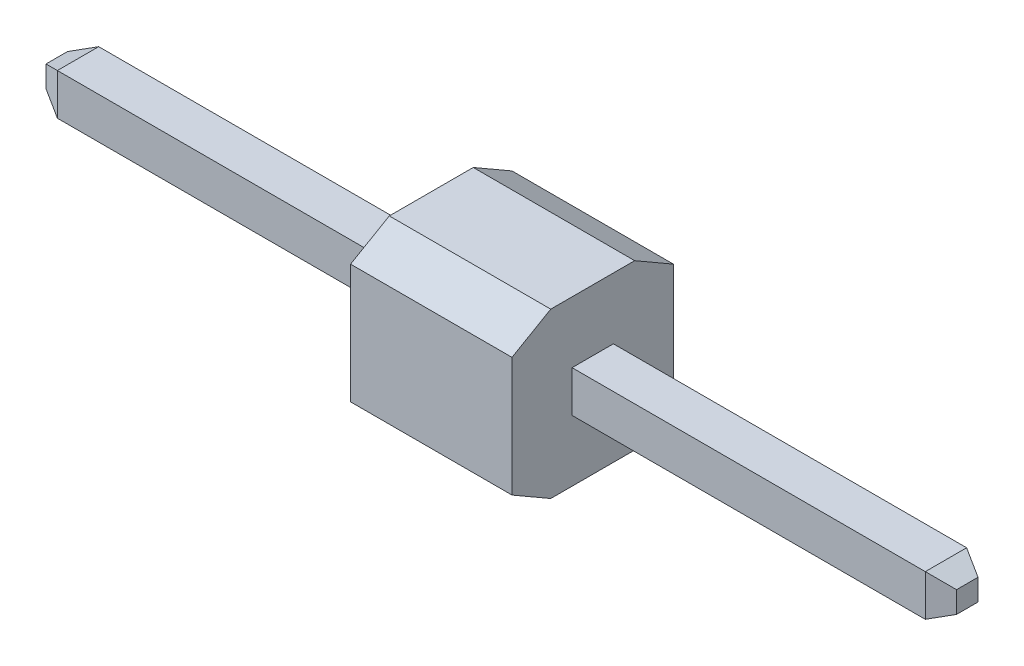
ISO-10303-21;
HEADER;
FILE_DESCRIPTION(('STEP AP214'),'2;1');
FILE_NAME('part.step','',(''),(''),'','','');
FILE_SCHEMA(('AUTOMOTIVE_DESIGN { 1 0 10303 214 1 1 1 1 }'));
ENDSEC;
DATA;
#1=APPLICATION_CONTEXT('core data for automotive mechanical design processes');
#2=APPLICATION_PROTOCOL_DEFINITION('international standard','automotive_design',2000,#1);
#3=PRODUCT_CONTEXT('',#1,'mechanical');
#4=PRODUCT('Part','Part','',(#3));
#5=PRODUCT_RELATED_PRODUCT_CATEGORY('part','',(#4));
#6=PRODUCT_DEFINITION_FORMATION('','',#4);
#7=PRODUCT_DEFINITION_CONTEXT('part definition',#1,'design');
#8=PRODUCT_DEFINITION('design','',#6,#7);
#9=PRODUCT_DEFINITION_SHAPE('','',#8);
#10=(LENGTH_UNIT() NAMED_UNIT(*) SI_UNIT(.MILLI.,.METRE.));
#11=(NAMED_UNIT(*) PLANE_ANGLE_UNIT() SI_UNIT($,.RADIAN.));
#12=(NAMED_UNIT(*) SI_UNIT($,.STERADIAN.) SOLID_ANGLE_UNIT());
#13=UNCERTAINTY_MEASURE_WITH_UNIT(LENGTH_MEASURE(1.E-05),#10,'distance_accuracy_value','');
#14=(GEOMETRIC_REPRESENTATION_CONTEXT(3) GLOBAL_UNCERTAINTY_ASSIGNED_CONTEXT((#13)) GLOBAL_UNIT_ASSIGNED_CONTEXT((#10,
#11,#12)) REPRESENTATION_CONTEXT('',''));
#15=CARTESIAN_POINT('',(0.,0.,0.));
#16=DIRECTION('',(0.,0.,1.));
#17=DIRECTION('',(1.,0.,0.));
#18=AXIS2_PLACEMENT_3D('',#15,#16,#17);
#19=CARTESIAN_POINT('',(5.42110170937414,13.0171157260571,-2.77112170583403));
#20=DIRECTION('',(1.,-9.93476518829084E-08,4.37113882867379E-08));
#21=DIRECTION('',(-9.93476589883358E-08,-1.,8.74227765734759E-08));
#22=AXIS2_PLACEMENT_3D('',#19,#20,#21);
#23=PLANE('',#22);
#24=DIRECTION('',(-1.18186632779335E-08,-0.50000007571054,-0.866025360072934));
#25=VECTOR('',#24,1.);
#26=CARTESIAN_POINT('',(5.42110151719953,11.7735260248209,-1.20112159711595));
#27=LINE('',#26,#25);
#28=CARTESIAN_POINT('',(5.42110151719953,11.7735260248209,-1.20112159711595));
#29=VERTEX_POINT('',#28);
#30=CARTESIAN_POINT('',(5.42110150901132,11.4271158108572,-1.80112156683181));
#31=VERTEX_POINT('',#30);
#32=EDGE_CURVE('E11',#29,#31,#27,.T.);
#33=ORIENTED_EDGE('',*,*,#32,.T.);
#34=DIRECTION('',(4.37113811813104E-08,-8.74227842254741E-08,-0.999999999999995));
#35=VECTOR('',#34,1.);
#36=CARTESIAN_POINT('',(5.42110150901132,11.4271158108572,-1.80112156683181));
#37=LINE('',#36,#35);
#38=CARTESIAN_POINT('',(5.42110156583612,11.4271156972076,-3.10112156683181));
#39=VERTEX_POINT('',#38);
#40=EDGE_CURVE('E304',#31,#39,#37,.T.);
#41=ORIENTED_EDGE('',*,*,#40,.T.);
#42=DIRECTION('',(8.75289963531793E-08,0.499999924289839,-0.866025447495712));
#43=VECTOR('',#42,1.);
#44=CARTESIAN_POINT('',(5.42110156583612,11.4271156972076,-3.10112156683181));
#45=LINE('',#44,#43);
#46=CARTESIAN_POINT('',(5.42110162647799,11.773525806264,-3.70112159711595));
#47=VERTEX_POINT('',#46);
#48=EDGE_CURVE('E296',#39,#47,#45,.T.);
#49=ORIENTED_EDGE('',*,*,#48,.T.);
#50=DIRECTION('',(9.93476588436478E-08,0.999999999999991,-8.74227764822788E-08));
#51=VECTOR('',#50,1.);
#52=CARTESIAN_POINT('',(5.42110162647799,11.773525806264,-3.70112159711595));
#53=LINE('',#52,#51);
#54=CARTESIAN_POINT('',(5.42110180999096,13.620705483234,-3.70112175860153));
#55=VERTEX_POINT('',#54);
#56=EDGE_CURVE('E281',#47,#55,#53,.T.);
#57=ORIENTED_EDGE('',*,*,#56,.T.);
#58=DIRECTION('',(-1.18186632778483E-08,-0.500000075710537,-0.866025360072935));
#59=VECTOR('',#58,1.);
#60=CARTESIAN_POINT('',(5.42110181817917,13.9671156972076,-3.10112178888567));
#61=LINE('',#60,#59);
#62=CARTESIAN_POINT('',(5.42110181817917,13.9671156972076,-3.10112178888567));
#63=VERTEX_POINT('',#62);
#64=EDGE_CURVE('E265',#63,#55,#61,.T.);
#65=ORIENTED_EDGE('',*,*,#64,.F.);
#66=DIRECTION('',(4.37113811813104E-08,-8.74227842254741E-08,-0.999999999999995));
#67=VECTOR('',#66,1.);
#68=CARTESIAN_POINT('',(5.42110176135438,13.9671158108572,-1.80112178888567));
#69=LINE('',#68,#67);
#70=CARTESIAN_POINT('',(5.42110176135438,13.9671158108572,-1.80112178888567));
#71=VERTEX_POINT('',#70);
#72=EDGE_CURVE('E248',#71,#63,#69,.T.);
#73=ORIENTED_EDGE('',*,*,#72,.F.);
#74=DIRECTION('',(8.75289963525477E-08,0.499999924289836,-0.866025447495714));
#75=VECTOR('',#74,1.);
#76=CARTESIAN_POINT('',(5.42110170071251,13.6207057017909,-1.20112175860153));
#77=LINE('',#76,#75);
#78=CARTESIAN_POINT('',(5.42110170071251,13.6207057017909,-1.20112175860153));
#79=VERTEX_POINT('',#78);
#80=EDGE_CURVE('E242',#79,#71,#77,.T.);
#81=ORIENTED_EDGE('',*,*,#80,.F.);
#82=DIRECTION('',(9.93476588436478E-08,0.999999999999991,-8.74227763620714E-08));
#83=VECTOR('',#82,1.);
#84=CARTESIAN_POINT('',(5.42110151719953,11.7735260248209,-1.20112159711595));
#85=LINE('',#84,#83);
#86=EDGE_CURVE('E236',#29,#79,#85,.T.);
#87=ORIENTED_EDGE('',*,*,#86,.F.);
#88=EDGE_LOOP('',(#33,#41,#49,#57,#65,#73,#81,#87));
#89=FACE_BOUND('',#88,.T.);
#90=DIRECTION('',(-4.37113803486431E-08,8.74227856773042E-08,0.999999999999995));
#91=VECTOR('',#90,1.);
#92=CARTESIAN_POINT('',(5.42110164579164,12.3771157260571,-2.77112164988345));
#93=LINE('',#92,#91);
#94=CARTESIAN_POINT('',(5.42110164579164,12.3771157260571,-2.77112164988345));
#95=VERTEX_POINT('',#94);
#96=CARTESIAN_POINT('',(5.42110161781636,12.3771157820077,-2.13112164988345));
#97=VERTEX_POINT('',#96);
#98=EDGE_CURVE('E302',#95,#97,#93,.T.);
#99=ORIENTED_EDGE('',*,*,#98,.T.);
#100=DIRECTION('',(-9.93476578781123E-08,-0.999999999999991,8.74227766567422E-08));
#101=VECTOR('',#100,1.);
#102=CARTESIAN_POINT('',(5.42110168139886,13.0171157820077,-2.13112170583403));
#103=LINE('',#102,#101);
#104=CARTESIAN_POINT('',(5.42110168139886,13.0171157820077,-2.13112170583403));
#105=VERTEX_POINT('',#104);
#106=EDGE_CURVE('E293',#105,#97,#103,.T.);
#107=ORIENTED_EDGE('',*,*,#106,.F.);
#108=DIRECTION('',(-4.37113817364219E-08,8.74227856773042E-08,0.999999999999995));
#109=VECTOR('',#108,1.);
#110=CARTESIAN_POINT('',(5.42110170937414,13.0171157260571,-2.77112170583403));
#111=LINE('',#110,#109);
#112=CARTESIAN_POINT('',(5.42110170937414,13.0171157260571,-2.77112170583403));
#113=VERTEX_POINT('',#112);
#114=EDGE_CURVE('E278',#113,#105,#111,.T.);
#115=ORIENTED_EDGE('',*,*,#114,.F.);
#116=DIRECTION('',(-9.93476592658911E-08,-0.999999999999991,8.74227766567422E-08));
#117=VECTOR('',#116,1.);
#118=CARTESIAN_POINT('',(5.42110170937414,13.0171157260571,-2.77112170583403));
#119=LINE('',#118,#117);
#120=EDGE_CURVE('E263',#113,#95,#119,.T.);
#121=ORIENTED_EDGE('',*,*,#120,.T.);
#122=EDGE_LOOP('',(#99,#107,#115,#121));
#123=FACE_BOUND('',#122,.T.);
#124=ADVANCED_FACE('F17',(#89,#123),#23,.T.);
#125=CARTESIAN_POINT('',(2.92110170937414,13.0171159744263,-2.7711218151125));
#126=DIRECTION('',(1.,-9.93476518829084E-08,4.37113882867379E-08));
#127=DIRECTION('',(-9.93476589883358E-08,-1.,8.74227765734759E-08));
#128=AXIS2_PLACEMENT_3D('',#125,#126,#127);
#129=PLANE('',#128);
#130=DIRECTION('',(-1.1818662636946E-08,-0.50000007571054,-0.866025360072934));
#131=VECTOR('',#130,1.);
#132=CARTESIAN_POINT('',(2.92110151719953,11.77352627319,-1.20112170639442));
#133=LINE('',#132,#131);
#134=CARTESIAN_POINT('',(2.92110151719953,11.77352627319,-1.20112170639442));
#135=VERTEX_POINT('',#134);
#136=CARTESIAN_POINT('',(2.92110150901132,11.4271160592264,-1.80112167611028));
#137=VERTEX_POINT('',#136);
#138=EDGE_CURVE('E24',#135,#137,#133,.T.);
#139=ORIENTED_EDGE('',*,*,#138,.F.);
#140=DIRECTION('',(9.93476590840625E-08,0.999999999999991,-8.74227763620714E-08));
#141=VECTOR('',#140,1.);
#142=CARTESIAN_POINT('',(2.92110151719953,11.77352627319,-1.20112170639442));
#143=LINE('',#142,#141);
#144=CARTESIAN_POINT('',(2.92110170071251,13.62070595016,-1.20112186788));
#145=VERTEX_POINT('',#144);
#146=EDGE_CURVE('E300',#135,#145,#143,.T.);
#147=ORIENTED_EDGE('',*,*,#146,.T.);
#148=DIRECTION('',(8.75289957115602E-08,0.499999924289836,-0.866025447495714));
#149=VECTOR('',#148,1.);
#150=CARTESIAN_POINT('',(2.92110170071251,13.62070595016,-1.20112186788));
#151=LINE('',#150,#149);
#152=CARTESIAN_POINT('',(2.92110176135438,13.9671160592264,-1.80112189816414));
#153=VERTEX_POINT('',#152);
#154=EDGE_CURVE('E286',#145,#153,#151,.T.);
#155=ORIENTED_EDGE('',*,*,#154,.T.);
#156=DIRECTION('',(4.37113811813104E-08,-8.74227842254741E-08,-0.999999999999995));
#157=VECTOR('',#156,1.);
#158=CARTESIAN_POINT('',(2.92110176135438,13.9671160592264,-1.80112189816414));
#159=LINE('',#158,#157);
#160=CARTESIAN_POINT('',(2.92110181817917,13.9671159455768,-3.10112189816414));
#161=VERTEX_POINT('',#160);
#162=EDGE_CURVE('E271',#153,#161,#159,.T.);
#163=ORIENTED_EDGE('',*,*,#162,.T.);
#164=DIRECTION('',(-1.18186626368607E-08,-0.500000075710537,-0.866025360072935));
#165=VECTOR('',#164,1.);
#166=CARTESIAN_POINT('',(2.92110181817917,13.9671159455768,-3.10112189816414));
#167=LINE('',#166,#165);
#168=CARTESIAN_POINT('',(2.92110180999096,13.6207057316031,-3.70112186788));
#169=VERTEX_POINT('',#168);
#170=EDGE_CURVE('E253',#161,#169,#167,.T.);
#171=ORIENTED_EDGE('',*,*,#170,.T.);
#172=DIRECTION('',(9.93476590840625E-08,0.999999999999991,-8.74227764822788E-08));
#173=VECTOR('',#172,1.);
#174=CARTESIAN_POINT('',(2.92110162647799,11.7735260546331,-3.70112170639442));
#175=LINE('',#174,#173);
#176=CARTESIAN_POINT('',(2.92110162647799,11.7735260546331,-3.70112170639442));
#177=VERTEX_POINT('',#176);
#178=EDGE_CURVE('E261',#177,#169,#175,.T.);
#179=ORIENTED_EDGE('',*,*,#178,.F.);
#180=DIRECTION('',(8.75289957121918E-08,0.499999924289839,-0.866025447495712));
#181=VECTOR('',#180,1.);
#182=CARTESIAN_POINT('',(2.92110156583612,11.4271159455767,-3.10112167611028));
#183=LINE('',#182,#181);
#184=CARTESIAN_POINT('',(2.92110156583612,11.4271159455767,-3.10112167611028));
#185=VERTEX_POINT('',#184);
#186=EDGE_CURVE('E276',#185,#177,#183,.T.);
#187=ORIENTED_EDGE('',*,*,#186,.F.);
#188=DIRECTION('',(4.37113811813104E-08,-8.74227842254741E-08,-0.999999999999995));
#189=VECTOR('',#188,1.);
#190=CARTESIAN_POINT('',(2.92110150901132,11.4271160592264,-1.80112167611028));
#191=LINE('',#190,#189);
#192=EDGE_CURVE('E291',#137,#185,#191,.T.);
#193=ORIENTED_EDGE('',*,*,#192,.F.);
#194=EDGE_LOOP('',(#139,#147,#155,#163,#171,#179,#187,#193));
#195=FACE_BOUND('',#194,.T.);
#196=DIRECTION('',(-9.93476592658911E-08,-0.999999999999991,8.74227766567422E-08));
#197=VECTOR('',#196,1.);
#198=CARTESIAN_POINT('',(2.92110168139886,13.0171160303769,-2.1311218151125));
#199=LINE('',#198,#197);
#200=CARTESIAN_POINT('',(2.92110168139886,13.0171160303769,-2.1311218151125));
#201=VERTEX_POINT('',#200);
#202=CARTESIAN_POINT('',(2.92110161781636,12.3771160303769,-2.13112175916192));
#203=VERTEX_POINT('',#202);
#204=EDGE_CURVE('E298',#201,#203,#199,.T.);
#205=ORIENTED_EDGE('',*,*,#204,.T.);
#206=DIRECTION('',(-4.37113810425325E-08,8.74227856773042E-08,0.999999999999995));
#207=VECTOR('',#206,1.);
#208=CARTESIAN_POINT('',(2.92110164579164,12.3771159744263,-2.77112175916192));
#209=LINE('',#208,#207);
#210=CARTESIAN_POINT('',(2.92110164579164,12.3771159744263,-2.77112175916192));
#211=VERTEX_POINT('',#210);
#212=EDGE_CURVE('E283',#211,#203,#209,.T.);
#213=ORIENTED_EDGE('',*,*,#212,.F.);
#214=DIRECTION('',(-9.93476592658911E-08,-0.999999999999991,8.74227766567422E-08));
#215=VECTOR('',#214,1.);
#216=CARTESIAN_POINT('',(2.92110170937414,13.0171159744263,-2.7711218151125));
#217=LINE('',#216,#215);
#218=CARTESIAN_POINT('',(2.92110170937414,13.0171159744263,-2.7711218151125));
#219=VERTEX_POINT('',#218);
#220=EDGE_CURVE('E268',#219,#211,#217,.T.);
#221=ORIENTED_EDGE('',*,*,#220,.F.);
#222=DIRECTION('',(-4.37113810425325E-08,8.74227856773042E-08,0.999999999999995));
#223=VECTOR('',#222,1.);
#224=CARTESIAN_POINT('',(2.92110170937414,13.0171159744263,-2.7711218151125));
#225=LINE('',#224,#223);
#226=EDGE_CURVE('E251',#219,#201,#225,.T.);
#227=ORIENTED_EDGE('',*,*,#226,.T.);
#228=EDGE_LOOP('',(#205,#213,#221,#227));
#229=FACE_BOUND('',#228,.T.);
#230=ADVANCED_FACE('F314',(#195,#229),#129,.F.);
#231=CARTESIAN_POINT('',(5.42110151719953,11.7735260248209,-1.20112159711595));
#232=DIRECTION('',(1.07893287081065E-07,0.866025360072937,-0.500000075710535));
#233=DIRECTION('',(1.18186629566715E-08,0.500000075710542,0.866025360072941));
#234=AXIS2_PLACEMENT_3D('',#231,#232,#233);
#235=PLANE('',#234);
#236=ORIENTED_EDGE('',*,*,#138,.T.);
#237=DIRECTION('',(-0.999999999999994,9.93476533039933E-08,-4.37113883755555E-08));
#238=VECTOR('',#237,1.);
#239=CARTESIAN_POINT('',(5.42110150901132,11.4271158108572,-1.80112156683181));
#240=LINE('',#239,#238);
#241=EDGE_CURVE('E288',#31,#137,#240,.T.);
#242=ORIENTED_EDGE('',*,*,#241,.F.);
#243=ORIENTED_EDGE('',*,*,#32,.F.);
#244=DIRECTION('',(-0.999999999999994,9.93476504618223E-08,-4.3711388109102E-08));
#245=VECTOR('',#244,1.);
#246=CARTESIAN_POINT('',(5.42110151719953,11.7735260248209,-1.20112159711595));
#247=LINE('',#246,#245);
#248=EDGE_CURVE('E256',#29,#135,#247,.T.);
#249=ORIENTED_EDGE('',*,*,#248,.T.);
#250=EDGE_LOOP('',(#236,#242,#243,#249));
#251=FACE_BOUND('',#250,.T.);
#252=ADVANCED_FACE('F306',(#251),#235,.F.);
#253=CARTESIAN_POINT('',(5.42110150901132,11.4271158108572,-1.80112156683181));
#254=DIRECTION('',(9.93476589883358E-08,1.,-8.74227765734759E-08));
#255=DIRECTION('',(1.,-9.93476518829084E-08,4.37113882867379E-08));
#256=AXIS2_PLACEMENT_3D('',#253,#254,#255);
#257=PLANE('',#256);
#258=ORIENTED_EDGE('',*,*,#192,.T.);
#259=DIRECTION('',(-0.999999999999994,9.93476533039933E-08,-4.37113884643734E-08));
#260=VECTOR('',#259,1.);
#261=CARTESIAN_POINT('',(5.42110156583612,11.4271156972076,-3.10112156683181));
#262=LINE('',#261,#260);
#263=EDGE_CURVE('E273',#39,#185,#262,.T.);
#264=ORIENTED_EDGE('',*,*,#263,.F.);
#265=ORIENTED_EDGE('',*,*,#40,.F.);
#266=ORIENTED_EDGE('',*,*,#241,.T.);
#267=EDGE_LOOP('',(#258,#264,#265,#266));
#268=FACE_BOUND('',#267,.T.);
#269=ADVANCED_FACE('F311',(#268),#257,.F.);
#270=CARTESIAN_POINT('',(5.42110156583612,11.4271156972076,-3.10112156683181));
#271=DIRECTION('',(6.41819058997377E-08,0.866025447495721,0.499999924289845));
#272=DIRECTION('',(-8.7528996031702E-08,-0.499999924289838,0.866025447495717));
#273=AXIS2_PLACEMENT_3D('',#270,#271,#272);
#274=PLANE('',#273);
#275=ORIENTED_EDGE('',*,*,#186,.T.);
#276=DIRECTION('',(-0.999999999999994,9.93476504618223E-08,-4.37113882867377E-08));
#277=VECTOR('',#276,1.);
#278=CARTESIAN_POINT('',(5.42110162647799,11.773525806264,-3.70112159711595));
#279=LINE('',#278,#277);
#280=EDGE_CURVE('E258',#47,#177,#279,.T.);
#281=ORIENTED_EDGE('',*,*,#280,.F.);
#282=ORIENTED_EDGE('',*,*,#48,.F.);
#283=ORIENTED_EDGE('',*,*,#263,.T.);
#284=EDGE_LOOP('',(#275,#281,#282,#283));
#285=FACE_BOUND('',#284,.T.);
#286=ADVANCED_FACE('F319',(#285),#274,.F.);
#287=CARTESIAN_POINT('',(5.42110162647799,11.773525806264,-3.70112159711595));
#288=DIRECTION('',(-4.37113811813106E-08,8.74227836789032E-08,1.));
#289=DIRECTION('',(-1.,9.93476518829084E-08,-4.37113882867379E-08));
#290=AXIS2_PLACEMENT_3D('',#287,#288,#289);
#291=PLANE('',#290);
#292=ORIENTED_EDGE('',*,*,#178,.T.);
#293=DIRECTION('',(-0.999999999999994,9.93476533039933E-08,-4.37113884643734E-08));
#294=VECTOR('',#293,1.);
#295=CARTESIAN_POINT('',(5.42110180999096,13.620705483234,-3.70112175860153));
#296=LINE('',#295,#294);
#297=EDGE_CURVE('E245',#55,#169,#296,.T.);
#298=ORIENTED_EDGE('',*,*,#297,.F.);
#299=ORIENTED_EDGE('',*,*,#56,.F.);
#300=ORIENTED_EDGE('',*,*,#280,.T.);
#301=EDGE_LOOP('',(#292,#298,#299,#300));
#302=FACE_BOUND('',#301,.T.);
#303=ADVANCED_FACE('F326',(#302),#291,.F.);
#304=CARTESIAN_POINT('',(5.42110181817917,13.9671156972076,-3.10112178888567));
#305=DIRECTION('',(1.07893287081065E-07,0.866025360072937,-0.500000075710535));
#306=DIRECTION('',(1.18186629566715E-08,0.500000075710542,0.866025360072941));
#307=AXIS2_PLACEMENT_3D('',#304,#305,#306);
#308=PLANE('',#307);
#309=ORIENTED_EDGE('',*,*,#170,.F.);
#310=DIRECTION('',(-0.999999999999994,9.93476490407369E-08,-4.37113882867377E-08));
#311=VECTOR('',#310,1.);
#312=CARTESIAN_POINT('',(5.42110181817917,13.9671156972076,-3.10112178888567));
#313=LINE('',#312,#311);
#314=EDGE_CURVE('E239',#63,#161,#313,.T.);
#315=ORIENTED_EDGE('',*,*,#314,.F.);
#316=ORIENTED_EDGE('',*,*,#64,.T.);
#317=ORIENTED_EDGE('',*,*,#297,.T.);
#318=EDGE_LOOP('',(#309,#315,#316,#317));
#319=FACE_BOUND('',#318,.T.);
#320=ADVANCED_FACE('F329',(#319),#308,.T.);
#321=CARTESIAN_POINT('',(5.42110176135438,13.9671158108572,-1.80112178888567));
#322=DIRECTION('',(9.93476589883358E-08,1.,-8.74227765734759E-08));
#323=DIRECTION('',(1.,-9.93476518829084E-08,4.37113882867379E-08));
#324=AXIS2_PLACEMENT_3D('',#321,#322,#323);
#325=PLANE('',#324);
#326=ORIENTED_EDGE('',*,*,#162,.F.);
#327=DIRECTION('',(-0.999999999999994,9.93476490407369E-08,-4.37113882867377E-08));
#328=VECTOR('',#327,1.);
#329=CARTESIAN_POINT('',(5.42110176135438,13.9671158108572,-1.80112178888567));
#330=LINE('',#329,#328);
#331=EDGE_CURVE('E233',#71,#153,#330,.T.);
#332=ORIENTED_EDGE('',*,*,#331,.F.);
#333=ORIENTED_EDGE('',*,*,#72,.T.);
#334=ORIENTED_EDGE('',*,*,#314,.T.);
#335=EDGE_LOOP('',(#326,#332,#333,#334));
#336=FACE_BOUND('',#335,.T.);
#337=ADVANCED_FACE('F333',(#336),#325,.T.);
#338=CARTESIAN_POINT('',(5.42110170071251,13.6207057017909,-1.20112175860153));
#339=DIRECTION('',(6.41819058997377E-08,0.866025447495721,0.499999924289845));
#340=DIRECTION('',(-8.7528996031702E-08,-0.499999924289838,0.866025447495717));
#341=AXIS2_PLACEMENT_3D('',#338,#339,#340);
#342=PLANE('',#341);
#343=ORIENTED_EDGE('',*,*,#154,.F.);
#344=DIRECTION('',(-0.999999999999994,9.93476533039933E-08,-4.3711388109102E-08));
#345=VECTOR('',#344,1.);
#346=CARTESIAN_POINT('',(5.42110170071251,13.6207057017909,-1.20112175860153));
#347=LINE('',#346,#345);
#348=EDGE_CURVE('E230',#79,#145,#347,.T.);
#349=ORIENTED_EDGE('',*,*,#348,.F.);
#350=ORIENTED_EDGE('',*,*,#80,.T.);
#351=ORIENTED_EDGE('',*,*,#331,.T.);
#352=EDGE_LOOP('',(#343,#349,#350,#351));
#353=FACE_BOUND('',#352,.T.);
#354=ADVANCED_FACE('F337',(#353),#342,.T.);
#355=CARTESIAN_POINT('',(5.42110151719953,11.7735260248209,-1.20112159711595));
#356=DIRECTION('',(-4.37113811813106E-08,8.74227835615132E-08,1.));
#357=DIRECTION('',(-9.93476589883358E-08,-1.,8.74227764560859E-08));
#358=AXIS2_PLACEMENT_3D('',#355,#356,#357);
#359=PLANE('',#358);
#360=ORIENTED_EDGE('',*,*,#146,.F.);
#361=ORIENTED_EDGE('',*,*,#248,.F.);
#362=ORIENTED_EDGE('',*,*,#86,.T.);
#363=ORIENTED_EDGE('',*,*,#348,.T.);
#364=EDGE_LOOP('',(#360,#361,#362,#363));
#365=FACE_BOUND('',#364,.T.);
#366=ADVANCED_FACE('F339',(#365),#359,.T.);
#367=CARTESIAN_POINT('',(-2.87889829062586,13.0171165506426,-2.77112206863855));
#368=DIRECTION('',(-1.,9.93476518829084E-08,-4.37113882867379E-08));
#369=DIRECTION('',(9.93476589883358E-08,1.,-8.74227765734759E-08));
#370=AXIS2_PLACEMENT_3D('',#367,#368,#369);
#371=PLANE('',#370);
#372=DIRECTION('',(9.93476608211201E-08,0.999999999999991,-8.7422776141512E-08));
#373=VECTOR('',#372,1.);
#374=CARTESIAN_POINT('',(-2.8788983601695,12.5309981203305,-2.28500355333172));
#375=LINE('',#374,#373);
#376=CARTESIAN_POINT('',(-2.8788983601695,12.5309981203305,-2.28500355333172));
#377=VERTEX_POINT('',#376);
#378=CARTESIAN_POINT('',(-2.87889832716254,12.8632350659405,-2.2850035823768));
#379=VERTEX_POINT('',#378);
#380=EDGE_CURVE('E228',#377,#379,#375,.T.);
#381=ORIENTED_EDGE('',*,*,#380,.T.);
#382=DIRECTION('',(4.37113820547149E-08,-8.74227748027428E-08,-0.999999999999995));
#383=VECTOR('',#382,1.);
#384=CARTESIAN_POINT('',(-2.87889832716254,12.8632350659405,-2.2850035823768));
#385=LINE('',#384,#383);
#386=CARTESIAN_POINT('',(-2.87889831264,12.8632350368954,-2.6172405279948));
#387=VERTEX_POINT('',#386);
#388=EDGE_CURVE('E223',#379,#387,#385,.T.);
#389=ORIENTED_EDGE('',*,*,#388,.T.);
#390=DIRECTION('',(-9.93476581477919E-08,-0.999999999999991,8.74227774781761E-08));
#391=VECTOR('',#390,1.);
#392=CARTESIAN_POINT('',(-2.87889831264,12.8632350368954,-2.6172405279948));
#393=LINE('',#392,#391);
#394=CARTESIAN_POINT('',(-2.87889834564697,12.5309980912854,-2.61724049894973));
#395=VERTEX_POINT('',#394);
#396=EDGE_CURVE('E215',#387,#395,#393,.T.);
#397=ORIENTED_EDGE('',*,*,#396,.T.);
#398=DIRECTION('',(-4.37113740347301E-08,8.7422774802743E-08,0.999999999999995));
#399=VECTOR('',#398,1.);
#400=CARTESIAN_POINT('',(-2.87889834564697,12.5309980912854,-2.61724049894973));
#401=LINE('',#400,#399);
#402=EDGE_CURVE('E207',#395,#377,#401,.T.);
#403=ORIENTED_EDGE('',*,*,#402,.T.);
#404=EDGE_LOOP('',(#381,#389,#397,#403));
#405=FACE_BOUND('',#404,.T.);
#406=ADVANCED_FACE('F341',(#405),#371,.T.);
#407=CARTESIAN_POINT('',(-2.87889829062586,13.0171165506426,-2.77112206863855));
#408=DIRECTION('',(9.93476589883358E-08,1.,-8.74227764510112E-08));
#409=DIRECTION('',(-4.37113811813106E-08,8.74227835564385E-08,1.));
#410=AXIS2_PLACEMENT_3D('',#407,#408,#409);
#411=PLANE('',#410);
#412=DIRECTION('',(0.999999999999994,-9.93476508047534E-08,4.37113882769953E-08));
#413=VECTOR('',#412,1.);
#414=CARTESIAN_POINT('',(-2.54889829062586,13.0171165178579,-2.77112205421379));
#415=LINE('',#414,#413);
#416=CARTESIAN_POINT('',(-2.54889829062586,13.0171165178579,-2.77112205421379));
#417=VERTEX_POINT('',#416);
#418=EDGE_CURVE('E225',#417,#219,#415,.T.);
#419=ORIENTED_EDGE('',*,*,#418,.F.);
#420=DIRECTION('',(-4.37113817364219E-08,8.74227856773042E-08,0.999999999999995));
#421=VECTOR('',#420,1.);
#422=CARTESIAN_POINT('',(-2.54889829062586,13.0171165178579,-2.77112205421379));
#423=LINE('',#422,#421);
#424=CARTESIAN_POINT('',(-2.54889831860114,13.0171165738085,-2.13112205421379));
#425=VERTEX_POINT('',#424);
#426=EDGE_CURVE('E217',#417,#425,#423,.T.);
#427=ORIENTED_EDGE('',*,*,#426,.T.);
#428=DIRECTION('',(0.999999999999994,-9.93476508047534E-08,4.3711388195809E-08));
#429=VECTOR('',#428,1.);
#430=CARTESIAN_POINT('',(-2.54889831860114,13.0171165738085,-2.13112205421379));
#431=LINE('',#430,#429);
#432=EDGE_CURVE('E220',#425,#201,#431,.T.);
#433=ORIENTED_EDGE('',*,*,#432,.T.);
#434=ORIENTED_EDGE('',*,*,#226,.F.);
#435=EDGE_LOOP('',(#419,#427,#433,#434));
#436=FACE_BOUND('',#435,.T.);
#437=ADVANCED_FACE('F348',(#436),#411,.T.);
#438=CARTESIAN_POINT('',(-2.87889831860114,13.0171166065932,-2.13112206863855));
#439=DIRECTION('',(-4.37113811813106E-08,8.74227836789032E-08,1.));
#440=DIRECTION('',(-1.,9.93476518829084E-08,-4.37113882867379E-08));
#441=AXIS2_PLACEMENT_3D('',#438,#439,#440);
#442=PLANE('',#441);
#443=ORIENTED_EDGE('',*,*,#432,.F.);
#444=DIRECTION('',(-9.93476578781123E-08,-0.999999999999991,8.74227766567422E-08));
#445=VECTOR('',#444,1.);
#446=CARTESIAN_POINT('',(-2.54889831860114,13.0171165738085,-2.13112205421379));
#447=LINE('',#446,#445);
#448=CARTESIAN_POINT('',(-2.54889838218364,12.3771165738085,-2.13112199826322));
#449=VERTEX_POINT('',#448);
#450=EDGE_CURVE('E209',#425,#449,#447,.T.);
#451=ORIENTED_EDGE('',*,*,#450,.T.);
#452=DIRECTION('',(0.999999999999994,-9.93476508047534E-08,4.3711388195809E-08));
#453=VECTOR('',#452,1.);
#454=CARTESIAN_POINT('',(-2.54889838218364,12.3771165738085,-2.13112199826322));
#455=LINE('',#454,#453);
#456=EDGE_CURVE('E212',#449,#203,#455,.T.);
#457=ORIENTED_EDGE('',*,*,#456,.T.);
#458=ORIENTED_EDGE('',*,*,#204,.F.);
#459=EDGE_LOOP('',(#443,#451,#457,#458));
#460=FACE_BOUND('',#459,.T.);
#461=ADVANCED_FACE('F424',(#460),#442,.T.);
#462=CARTESIAN_POINT('',(-2.87889835420836,12.3771165506427,-2.77112201268797));
#463=DIRECTION('',(9.93476589883357E-08,1.,-8.74227764040693E-08));
#464=DIRECTION('',(-4.37113811813106E-08,8.74227835094966E-08,1.));
#465=AXIS2_PLACEMENT_3D('',#462,#463,#464);
#466=PLANE('',#465);
#467=ORIENTED_EDGE('',*,*,#456,.F.);
#468=DIRECTION('',(4.37113817364219E-08,-8.74227912284193E-08,-0.999999999999995));
#469=VECTOR('',#468,1.);
#470=CARTESIAN_POINT('',(-2.54889838218364,12.3771165738085,-2.13112199826322));
#471=LINE('',#470,#469);
#472=CARTESIAN_POINT('',(-2.54889835420836,12.3771165178579,-2.77112199826322));
#473=VERTEX_POINT('',#472);
#474=EDGE_CURVE('E201',#449,#473,#471,.T.);
#475=ORIENTED_EDGE('',*,*,#474,.T.);
#476=DIRECTION('',(0.999999999999994,-9.93476508047534E-08,4.37113882769953E-08));
#477=VECTOR('',#476,1.);
#478=CARTESIAN_POINT('',(-2.54889835420836,12.3771165178579,-2.77112199826322));
#479=LINE('',#478,#477);
#480=EDGE_CURVE('E204',#473,#211,#479,.T.);
#481=ORIENTED_EDGE('',*,*,#480,.T.);
#482=ORIENTED_EDGE('',*,*,#212,.T.);
#483=EDGE_LOOP('',(#467,#475,#481,#482));
#484=FACE_BOUND('',#483,.T.);
#485=ADVANCED_FACE('F421',(#484),#466,.F.);
#486=CARTESIAN_POINT('',(-2.87889829062586,13.0171165506426,-2.77112206863855));
#487=DIRECTION('',(-4.37113811813106E-08,8.74227836789032E-08,1.));
#488=DIRECTION('',(-1.,9.93476518829084E-08,-4.37113882867379E-08));
#489=AXIS2_PLACEMENT_3D('',#486,#487,#488);
#490=PLANE('',#489);
#491=ORIENTED_EDGE('',*,*,#480,.F.);
#492=DIRECTION('',(9.93476578781123E-08,0.999999999999991,-8.74227766567422E-08));
#493=VECTOR('',#492,1.);
#494=CARTESIAN_POINT('',(-2.54889835420836,12.3771165178579,-2.77112199826322));
#495=LINE('',#494,#493);
#496=EDGE_CURVE('E196',#473,#417,#495,.T.);
#497=ORIENTED_EDGE('',*,*,#496,.T.);
#498=ORIENTED_EDGE('',*,*,#418,.T.);
#499=ORIENTED_EDGE('',*,*,#220,.T.);
#500=EDGE_LOOP('',(#491,#497,#498,#499));
#501=FACE_BOUND('',#500,.T.);
#502=ADVANCED_FACE('F376',(#501),#490,.F.);
#503=CARTESIAN_POINT('',(-2.87889829062586,13.0171165506426,-2.77112206863855));
#504=DIRECTION('',(-4.37113811813106E-08,8.74227836789032E-08,1.));
#505=DIRECTION('',(-1.,9.93476518829084E-08,-4.37113882867379E-08));
#506=AXIS2_PLACEMENT_3D('',#503,#504,#505);
#507=PLANE('',#506);
#508=DIRECTION('',(0.999999999999994,-9.93476417118848E-08,4.37113882769953E-08));
#509=VECTOR('',#508,1.);
#510=CARTESIAN_POINT('',(5.42110170937414,13.0171157260571,-2.77112170583403));
#511=LINE('',#510,#509);
#512=CARTESIAN_POINT('',(10.8911017093741,13.0171151826255,-2.77112146673274));
#513=VERTEX_POINT('',#512);
#514=EDGE_CURVE('E199',#113,#513,#511,.T.);
#515=ORIENTED_EDGE('',*,*,#514,.T.);
#516=DIRECTION('',(-9.93476578781123E-08,-0.999999999999991,8.74227766567422E-08));
#517=VECTOR('',#516,1.);
#518=CARTESIAN_POINT('',(10.8911017093741,13.0171151826255,-2.77112146673274));
#519=LINE('',#518,#517);
#520=CARTESIAN_POINT('',(10.8911016457916,12.3771151826255,-2.77112141078216));
#521=VERTEX_POINT('',#520);
#522=EDGE_CURVE('E191',#513,#521,#519,.T.);
#523=ORIENTED_EDGE('',*,*,#522,.T.);
#524=DIRECTION('',(0.999999999999994,-9.93476572996596E-08,4.37113882769953E-08));
#525=VECTOR('',#524,1.);
#526=CARTESIAN_POINT('',(5.42110164579164,12.3771157260572,-2.77112164988345));
#527=LINE('',#526,#525);
#528=EDGE_CURVE('E194',#95,#521,#527,.T.);
#529=ORIENTED_EDGE('',*,*,#528,.F.);
#530=ORIENTED_EDGE('',*,*,#120,.F.);
#531=EDGE_LOOP('',(#515,#523,#529,#530));
#532=FACE_BOUND('',#531,.T.);
#533=ADVANCED_FACE('F367',(#532),#507,.F.);
#534=CARTESIAN_POINT('',(-2.87889835420836,12.3771165506427,-2.77112201268797));
#535=DIRECTION('',(9.93476589883357E-08,1.,-8.74227764040693E-08));
#536=DIRECTION('',(-4.37113811813106E-08,8.74227835094966E-08,1.));
#537=AXIS2_PLACEMENT_3D('',#534,#535,#536);
#538=PLANE('',#537);
#539=ORIENTED_EDGE('',*,*,#528,.T.);
#540=DIRECTION('',(-4.37113817364219E-08,8.74227856773042E-08,0.999999999999995));
#541=VECTOR('',#540,1.);
#542=CARTESIAN_POINT('',(10.8911016457916,12.3771151826255,-2.77112141078216));
#543=LINE('',#542,#541);
#544=CARTESIAN_POINT('',(10.8911016178164,12.3771152385761,-2.13112141078216));
#545=VERTEX_POINT('',#544);
#546=EDGE_CURVE('E186',#521,#545,#543,.T.);
#547=ORIENTED_EDGE('',*,*,#546,.T.);
#548=DIRECTION('',(0.999999999999994,-9.93476572996596E-08,4.37113881146227E-08));
#549=VECTOR('',#548,1.);
#550=CARTESIAN_POINT('',(5.42110161781636,12.3771157820077,-2.13112164988345));
#551=LINE('',#550,#549);
#552=EDGE_CURVE('E189',#97,#545,#551,.T.);
#553=ORIENTED_EDGE('',*,*,#552,.F.);
#554=ORIENTED_EDGE('',*,*,#98,.F.);
#555=EDGE_LOOP('',(#539,#547,#553,#554));
#556=FACE_BOUND('',#555,.T.);
#557=ADVANCED_FACE('F364',(#556),#538,.F.);
#558=CARTESIAN_POINT('',(-2.87889831860114,13.0171166065932,-2.13112206863855));
#559=DIRECTION('',(-4.37113811813106E-08,8.74227836789032E-08,1.));
#560=DIRECTION('',(-1.,9.93476518829084E-08,-4.37113882867379E-08));
#561=AXIS2_PLACEMENT_3D('',#558,#559,#560);
#562=PLANE('',#561);
#563=ORIENTED_EDGE('',*,*,#552,.T.);
#564=DIRECTION('',(9.93476606536699E-08,0.999999999999991,-8.74227766567422E-08));
#565=VECTOR('',#564,1.);
#566=CARTESIAN_POINT('',(10.8911016178164,12.3771152385761,-2.13112141078216));
#567=LINE('',#566,#565);
#568=CARTESIAN_POINT('',(10.8911016813989,13.0171152385761,-2.13112146673274));
#569=VERTEX_POINT('',#568);
#570=EDGE_CURVE('E176',#545,#569,#567,.T.);
#571=ORIENTED_EDGE('',*,*,#570,.T.);
#572=DIRECTION('',(0.999999999999994,-9.93476417118848E-08,4.37113881146227E-08));
#573=VECTOR('',#572,1.);
#574=CARTESIAN_POINT('',(5.42110168139886,13.0171157820077,-2.13112170583403));
#575=LINE('',#574,#573);
#576=EDGE_CURVE('E179',#105,#569,#575,.T.);
#577=ORIENTED_EDGE('',*,*,#576,.F.);
#578=ORIENTED_EDGE('',*,*,#106,.T.);
#579=EDGE_LOOP('',(#563,#571,#577,#578));
#580=FACE_BOUND('',#579,.T.);
#581=ADVANCED_FACE('F366',(#580),#562,.T.);
#582=CARTESIAN_POINT('',(-2.87889829062586,13.0171165506426,-2.77112206863855));
#583=DIRECTION('',(9.93476589883358E-08,1.,-8.74227764510112E-08));
#584=DIRECTION('',(-4.37113811813106E-08,8.74227835564385E-08,1.));
#585=AXIS2_PLACEMENT_3D('',#582,#583,#584);
#586=PLANE('',#585);
#587=ORIENTED_EDGE('',*,*,#576,.T.);
#588=DIRECTION('',(4.37113789608643E-08,-8.74227856773042E-08,-0.999999999999995));
#589=VECTOR('',#588,1.);
#590=CARTESIAN_POINT('',(10.8911016813989,13.0171152385761,-2.13112146673274));
#591=LINE('',#590,#589);
#592=EDGE_CURVE('E167',#569,#513,#591,.T.);
#593=ORIENTED_EDGE('',*,*,#592,.T.);
#594=ORIENTED_EDGE('',*,*,#514,.F.);
#595=ORIENTED_EDGE('',*,*,#114,.T.);
#596=EDGE_LOOP('',(#587,#593,#594,#595));
#597=FACE_BOUND('',#596,.T.);
#598=ADVANCED_FACE('F373',(#597),#586,.T.);
#599=CARTESIAN_POINT('',(11.2211017093741,13.0171151498408,-2.77112145230798));
#600=DIRECTION('',(-1.,9.93476518829084E-08,-4.37113882867379E-08));
#601=DIRECTION('',(9.93476589883358E-08,1.,-8.74227765734759E-08));
#602=AXIS2_PLACEMENT_3D('',#599,#600,#601);
#603=PLANE('',#602);
#604=DIRECTION('',(-9.93476581477919E-08,-0.999999999999991,8.74227774781761E-08));
#605=VECTOR('',#604,1.);
#606=CARTESIAN_POINT('',(11.2211016728375,12.8632336651386,-2.28500296604623));
#607=LINE('',#606,#605);
#608=CARTESIAN_POINT('',(11.2211016728375,12.8632336651386,-2.28500296604623));
#609=VERTEX_POINT('',#608);
#610=CARTESIAN_POINT('',(11.2211016398305,12.5309967195286,-2.28500293700115));
#611=VERTEX_POINT('',#610);
#612=EDGE_CURVE('E153',#609,#611,#607,.T.);
#613=ORIENTED_EDGE('',*,*,#612,.T.);
#614=DIRECTION('',(4.37113820547149E-08,-8.74228068826821E-08,-0.999999999999995));
#615=VECTOR('',#614,1.);
#616=CARTESIAN_POINT('',(11.2211016398305,12.5309967195286,-2.28500293700115));
#617=LINE('',#616,#615);
#618=CARTESIAN_POINT('',(11.221101654353,12.5309966904835,-2.61723988261915));
#619=VERTEX_POINT('',#618);
#620=EDGE_CURVE('E395',#611,#619,#617,.T.);
#621=ORIENTED_EDGE('',*,*,#620,.T.);
#622=DIRECTION('',(9.93476581477919E-08,0.999999999999991,-8.7422776141512E-08));
#623=VECTOR('',#622,1.);
#624=CARTESIAN_POINT('',(11.221101654353,12.5309966904835,-2.61723988261915));
#625=LINE('',#624,#623);
#626=CARTESIAN_POINT('',(11.22110168736,12.8632336360935,-2.61723991166423));
#627=VERTEX_POINT('',#626);
#628=EDGE_CURVE('E156',#619,#627,#625,.T.);
#629=ORIENTED_EDGE('',*,*,#628,.T.);
#630=DIRECTION('',(-4.37113874013715E-08,8.7422774802743E-08,0.999999999999995));
#631=VECTOR('',#630,1.);
#632=CARTESIAN_POINT('',(11.22110168736,12.8632336360935,-2.61723991166423));
#633=LINE('',#632,#631);
#634=EDGE_CURVE('E149',#627,#609,#633,.T.);
#635=ORIENTED_EDGE('',*,*,#634,.T.);
#636=EDGE_LOOP('',(#613,#621,#629,#635));
#637=FACE_BOUND('',#636,.T.);
#638=ADVANCED_FACE('F151',(#637),#603,.F.);
#639=CARTESIAN_POINT('',(-2.87889833892059,12.5309980778326,-2.77112202614072));
#640=DIRECTION('',(-0.422618351780369,-0.906307745050466,6.07587120833484E-08));
#641=DIRECTION('',(4.37113811813106E-08,-8.74227835094966E-08,-1.));
#642=AXIS2_PLACEMENT_3D('',#639,#640,#641);
#643=PLANE('',#642);
#644=DIRECTION('',(0.834817073788752,-0.389281669540033,0.389281691158098));
#645=VECTOR('',#644,1.);
#646=CARTESIAN_POINT('',(-2.87889836016952,12.53099812033,-2.28500355333221));
#647=LINE('',#646,#645);
#648=EDGE_CURVE('E181',#377,#449,#647,.T.);
#649=ORIENTED_EDGE('',*,*,#648,.F.);
#650=ORIENTED_EDGE('',*,*,#402,.F.);
#651=DIRECTION('',(-0.834817107820822,0.389281737604206,0.389281550111904));
#652=VECTOR('',#651,1.);
#653=CARTESIAN_POINT('',(-2.54889835420879,12.3771165178565,-2.77112199826268));
#654=LINE('',#653,#652);
#655=EDGE_CURVE('E404',#473,#395,#654,.T.);
#656=ORIENTED_EDGE('',*,*,#655,.F.);
#657=ORIENTED_EDGE('',*,*,#474,.F.);
#658=EDGE_LOOP('',(#649,#650,#656,#657));
#659=FACE_BOUND('',#658,.T.);
#660=ADVANCED_FACE('F418',(#659),#643,.T.);
#661=CARTESIAN_POINT('',(-2.87889829735223,13.0171165640954,-2.61724054144755));
#662=DIRECTION('',(-0.422618222124847,-3.72458176658199E-08,-0.906307805509828));
#663=DIRECTION('',(9.93476589883358E-08,1.,-8.74227765734759E-08));
#664=AXIS2_PLACEMENT_3D('',#661,#662,#663);
#665=PLANE('',#664);
#666=ORIENTED_EDGE('',*,*,#655,.T.);
#667=ORIENTED_EDGE('',*,*,#396,.F.);
#668=DIRECTION('',(-0.834817185169259,-0.389281503665788,0.389281618176067));
#669=VECTOR('',#668,1.);
#670=CARTESIAN_POINT('',(-2.54889829062471,13.0171165178552,-2.77112205421406));
#671=LINE('',#670,#669);
#672=EDGE_CURVE('E160',#417,#387,#671,.T.);
#673=ORIENTED_EDGE('',*,*,#672,.F.);
#674=ORIENTED_EDGE('',*,*,#496,.F.);
#675=EDGE_LOOP('',(#666,#667,#673,#674));
#676=FACE_BOUND('',#675,.T.);
#677=ADVANCED_FACE('F434',(#676),#665,.T.);
#678=CARTESIAN_POINT('',(-2.54889831860114,13.0171165738085,-2.13112205421379));
#679=DIRECTION('',(0.422618301356777,-1.21218081559392E-07,-0.906307768563367));
#680=DIRECTION('',(-9.93476589883358E-08,-1.,8.74227765734759E-08));
#681=AXIS2_PLACEMENT_3D('',#678,#679,#680);
#682=PLANE('',#681);
#683=ORIENTED_EDGE('',*,*,#648,.T.);
#684=ORIENTED_EDGE('',*,*,#450,.F.);
#685=DIRECTION('',(0.834817151137179,0.38928157172997,0.389281623093935));
#686=VECTOR('',#685,1.);
#687=CARTESIAN_POINT('',(-2.87889832716537,12.863235065948,-2.28500358237826));
#688=LINE('',#687,#686);
#689=EDGE_CURVE('E170',#379,#425,#688,.T.);
#690=ORIENTED_EDGE('',*,*,#689,.F.);
#691=ORIENTED_EDGE('',*,*,#380,.F.);
#692=EDGE_LOOP('',(#683,#684,#690,#691));
#693=FACE_BOUND('',#692,.T.);
#694=ADVANCED_FACE('F413',(#693),#682,.F.);
#695=CARTESIAN_POINT('',(-2.54889829062586,13.0171165178579,-2.77112205421379));
#696=DIRECTION('',(0.422618171701255,-0.906307829022729,9.770517399793E-08));
#697=DIRECTION('',(-4.37113811813106E-08,8.74227835564385E-08,1.));
#698=AXIS2_PLACEMENT_3D('',#695,#696,#697);
#699=PLANE('',#698);
#700=ORIENTED_EDGE('',*,*,#672,.T.);
#701=ORIENTED_EDGE('',*,*,#388,.F.);
#702=ORIENTED_EDGE('',*,*,#689,.T.);
#703=ORIENTED_EDGE('',*,*,#426,.F.);
#704=EDGE_LOOP('',(#700,#701,#702,#703));
#705=FACE_BOUND('',#704,.T.);
#706=ADVANCED_FACE('F429',(#705),#699,.F.);
#707=CARTESIAN_POINT('',(11.2211016940864,12.8632336226408,-2.77112143885523));
#708=DIRECTION('',(0.422618351780369,0.906307745050466,-6.07587121258922E-08));
#709=DIRECTION('',(4.37113811813106E-08,-8.74227835564385E-08,-1.));
#710=AXIS2_PLACEMENT_3D('',#707,#708,#709);
#711=PLANE('',#710);
#712=DIRECTION('',(-0.834817107820823,0.389281737604203,0.389281550111907));
#713=VECTOR('',#712,1.);
#714=CARTESIAN_POINT('',(11.2211016728375,12.8632336651391,-2.28500296604671));
#715=LINE('',#714,#713);
#716=EDGE_CURVE('E164',#609,#569,#715,.T.);
#717=ORIENTED_EDGE('',*,*,#716,.F.);
#718=ORIENTED_EDGE('',*,*,#634,.F.);
#719=DIRECTION('',(0.834817073788752,-0.389281669540035,0.389281691158098));
#720=VECTOR('',#719,1.);
#721=CARTESIAN_POINT('',(10.8911017093741,13.0171151826255,-2.77112146673274));
#722=LINE('',#721,#720);
#723=EDGE_CURVE('E392',#513,#627,#722,.T.);
#724=ORIENTED_EDGE('',*,*,#723,.F.);
#725=ORIENTED_EDGE('',*,*,#592,.F.);
#726=EDGE_LOOP('',(#717,#718,#724,#725));
#727=FACE_BOUND('',#726,.T.);
#728=ADVANCED_FACE('F165',(#727),#711,.T.);
#729=CARTESIAN_POINT('',(10.8911017093741,13.0171151826255,-2.77112146673274));
#730=DIRECTION('',(-0.422618301356777,1.21218081559392E-07,0.906307768563367));
#731=DIRECTION('',(-9.93476589883358E-08,-1.,8.74227765734759E-08));
#732=AXIS2_PLACEMENT_3D('',#729,#730,#731);
#733=PLANE('',#732);
#734=ORIENTED_EDGE('',*,*,#723,.T.);
#735=ORIENTED_EDGE('',*,*,#628,.F.);
#736=DIRECTION('',(0.834817151137182,0.389281571729965,0.389281623093934));
#737=VECTOR('',#736,1.);
#738=CARTESIAN_POINT('',(10.8911016457932,12.3771151826213,-2.77112141078126));
#739=LINE('',#738,#737);
#740=EDGE_CURVE('E389',#521,#619,#739,.T.);
#741=ORIENTED_EDGE('',*,*,#740,.F.);
#742=ORIENTED_EDGE('',*,*,#522,.F.);
#743=EDGE_LOOP('',(#734,#735,#741,#742));
#744=FACE_BOUND('',#743,.T.);
#745=ADVANCED_FACE('F390',(#744),#733,.F.);
#746=CARTESIAN_POINT('',(11.2211016881252,13.0171151923386,-2.28500297949898));
#747=DIRECTION('',(0.422618222124847,3.72458176658199E-08,0.906307805509828));
#748=DIRECTION('',(9.93476589883358E-08,1.,-8.74227765734759E-08));
#749=AXIS2_PLACEMENT_3D('',#746,#747,#748);
#750=PLANE('',#749);
#751=ORIENTED_EDGE('',*,*,#716,.T.);
#752=ORIENTED_EDGE('',*,*,#570,.F.);
#753=DIRECTION('',(-0.834817185169256,-0.389281503665799,0.389281618176065));
#754=VECTOR('',#753,1.);
#755=CARTESIAN_POINT('',(11.2211016398305,12.5309967195281,-2.28500293700163));
#756=LINE('',#755,#754);
#757=EDGE_CURVE('E175',#611,#545,#756,.T.);
#758=ORIENTED_EDGE('',*,*,#757,.F.);
#759=ORIENTED_EDGE('',*,*,#612,.F.);
#760=EDGE_LOOP('',(#751,#752,#758,#759));
#761=FACE_BOUND('',#760,.T.);
#762=ADVANCED_FACE('F173',(#761),#750,.T.);
#763=CARTESIAN_POINT('',(10.8911016457916,12.3771151826255,-2.77112141078216));
#764=DIRECTION('',(-0.422618171701255,0.906307829022729,-9.77051739553862E-08));
#765=DIRECTION('',(-4.37113811813106E-08,8.74227835094966E-08,1.));
#766=AXIS2_PLACEMENT_3D('',#763,#764,#765);
#767=PLANE('',#766);
#768=ORIENTED_EDGE('',*,*,#740,.T.);
#769=ORIENTED_EDGE('',*,*,#620,.F.);
#770=ORIENTED_EDGE('',*,*,#757,.T.);
#771=ORIENTED_EDGE('',*,*,#546,.F.);
#772=EDGE_LOOP('',(#768,#769,#770,#771));
#773=FACE_BOUND('',#772,.T.);
#774=ADVANCED_FACE('F394',(#773),#767,.F.);
#775=CLOSED_SHELL('',(#124,#230,#252,#269,#286,#303,#320,#337,#354,#366,#406,#437,#461,#485,
#502,#533,#557,#581,#598,#638,#660,#677,#694,#706,#728,#745,#762,#774));
#776=MANIFOLD_SOLID_BREP('B1',#775);
#777=ADVANCED_BREP_SHAPE_REPRESENTATION('',(#18,#776),#14);
#778=SHAPE_DEFINITION_REPRESENTATION(#9,#777);
ENDSEC;
END-ISO-10303-21;
